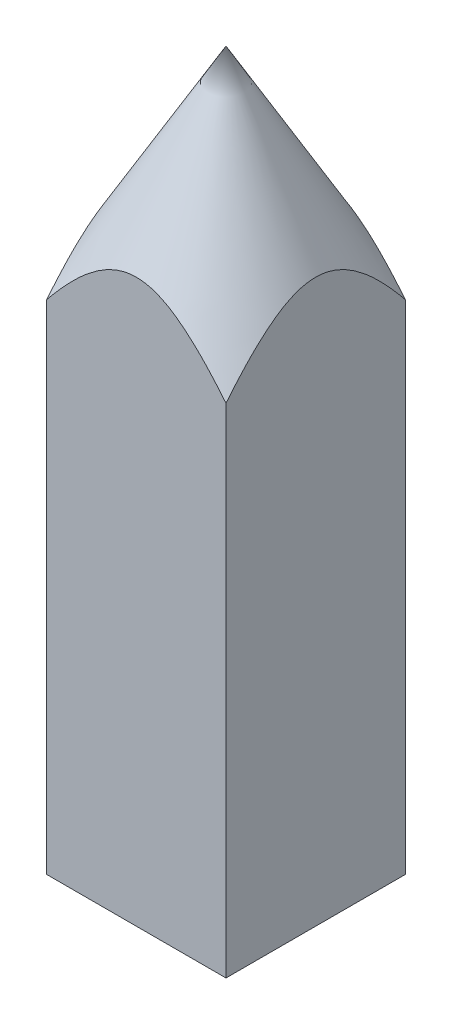
ISO-10303-21;
HEADER;
FILE_DESCRIPTION(('STEP AP214'),'2;1');
FILE_NAME('part.step','',(''),(''),'','','');
FILE_SCHEMA(('AUTOMOTIVE_DESIGN { 1 0 10303 214 1 1 1 1 }'));
ENDSEC;
DATA;
#1=APPLICATION_CONTEXT('core data for automotive mechanical design processes');
#2=APPLICATION_PROTOCOL_DEFINITION('international standard','automotive_design',2000,#1);
#3=PRODUCT_CONTEXT('',#1,'mechanical');
#4=PRODUCT('Part','Part','',(#3));
#5=PRODUCT_RELATED_PRODUCT_CATEGORY('part','',(#4));
#6=PRODUCT_DEFINITION_FORMATION('','',#4);
#7=PRODUCT_DEFINITION_CONTEXT('part definition',#1,'design');
#8=PRODUCT_DEFINITION('design','',#6,#7);
#9=PRODUCT_DEFINITION_SHAPE('','',#8);
#10=(LENGTH_UNIT() NAMED_UNIT(*) SI_UNIT(.MILLI.,.METRE.));
#11=(NAMED_UNIT(*) PLANE_ANGLE_UNIT() SI_UNIT($,.RADIAN.));
#12=(NAMED_UNIT(*) SI_UNIT($,.STERADIAN.) SOLID_ANGLE_UNIT());
#13=UNCERTAINTY_MEASURE_WITH_UNIT(LENGTH_MEASURE(1.E-05),#10,'distance_accuracy_value','');
#14=(GEOMETRIC_REPRESENTATION_CONTEXT(3) GLOBAL_UNCERTAINTY_ASSIGNED_CONTEXT((#13)) GLOBAL_UNIT_ASSIGNED_CONTEXT((#10,
#11,#12)) REPRESENTATION_CONTEXT('',''));
#15=CARTESIAN_POINT('',(0.,0.,0.));
#16=DIRECTION('',(0.,0.,1.));
#17=DIRECTION('',(1.,0.,0.));
#18=AXIS2_PLACEMENT_3D('',#15,#16,#17);
#19=CARTESIAN_POINT('',(0.,27.7525512860761,0.));
#20=DIRECTION('',(0.,-1.,0.));
#21=DIRECTION('',(0.,0.,-1.));
#22=AXIS2_PLACEMENT_3D('',#19,#20,#21);
#23=CONICAL_SURFACE('',#22,7.07106781187,0.523598775598293);
#24=CARTESIAN_POINT('',(-5.0000000000032,22.5683912344682,-8.73424265280935));
#25=CARTESIAN_POINT('',(-5.0000000000032,22.8488023325333,-8.54766544211133));
#26=CARTESIAN_POINT('',(-5.0000000000032,23.1285649924239,-8.36010390508928));
#27=CARTESIAN_POINT('',(-5.0000000000032,23.6864621174469,-7.98250325130816));
#28=CARTESIAN_POINT('',(-5.0000000000032,23.9645963791151,-7.79246383412938));
#29=CARTESIAN_POINT('',(-5.0000000000032,24.5202429395061,-7.40847202366486));
#30=CARTESIAN_POINT('',(-5.0000000000032,24.7977449184527,-7.21450466672879));
#31=CARTESIAN_POINT('',(-5.0000000000032,25.3501443903616,-6.82292758607559));
#32=CARTESIAN_POINT('',(-5.0000000000032,25.6250420497034,-6.62531809744771));
#33=CARTESIAN_POINT('',(-5.0000000000032,26.188603526577,-6.2130458318071));
#34=CARTESIAN_POINT('',(-5.0000000000032,26.4770533265441,-5.99808935307075));
#35=CARTESIAN_POINT('',(-5.0000000000032,27.0488803919948,-5.56155576253747));
#36=CARTESIAN_POINT('',(-5.0000000000032,27.3322580280372,-5.33997913757409));
#37=CARTESIAN_POINT('',(-5.0000000000032,27.891404034399,-4.8885254808277));
#38=CARTESIAN_POINT('',(-5.0000000000032,28.1671873104133,-4.65866711052706));
#39=CARTESIAN_POINT('',(-5.0000000000032,28.5730334827993,-4.30498586101745));
#40=CARTESIAN_POINT('',(-5.0000000000032,28.7069891422274,-4.18563039902351));
#41=CARTESIAN_POINT('',(-5.0000000000032,28.9716596249654,-3.94338595905392));
#42=CARTESIAN_POINT('',(-5.0000000000032,29.1023747793685,-3.82049734486626));
#43=CARTESIAN_POINT('',(-5.0000000000032,29.3006587775693,-3.62788939671447));
#44=CARTESIAN_POINT('',(-5.0000000000032,29.3696721084249,-3.55965615240548));
#45=CARTESIAN_POINT('',(-5.0000000000032,29.5063266042223,-3.42182961094149));
#46=CARTESIAN_POINT('',(-5.0000000000032,29.573967760085,-3.35223630479346));
#47=CARTESIAN_POINT('',(-5.0000000000032,29.7746016420278,-3.14114734004477));
#48=CARTESIAN_POINT('',(-5.0000000000032,29.9052498509677,-2.99739549056884));
#49=CARTESIAN_POINT('',(-5.0000000000032,30.1572599606067,-2.70358444641824));
#50=CARTESIAN_POINT('',(-5.0000000000032,30.2786783938822,-2.55357415983834));
#51=CARTESIAN_POINT('',(-5.0000000000032,30.5099360300796,-2.24494421601222));
#52=CARTESIAN_POINT('',(-5.0000000000032,30.6197847156706,-2.08633177328418));
#53=CARTESIAN_POINT('',(-5.0000000000032,30.8267067440477,-1.75349310468541));
#54=CARTESIAN_POINT('',(-5.0000000000032,30.9232393799582,-1.5789244827072));
#55=CARTESIAN_POINT('',(-5.0000000000032,31.091508471754,-1.21805588659846));
#56=CARTESIAN_POINT('',(-5.0000000000032,31.1632895384725,-1.03177774138264));
#57=CARTESIAN_POINT('',(-5.0000000000032,31.2415250010389,-0.759443677962484));
#58=CARTESIAN_POINT('',(-5.0000000000032,31.2618183654125,-0.677290209246679));
#59=CARTESIAN_POINT('',(-5.0000000000032,31.2956886568315,-0.511625448329237));
#60=CARTESIAN_POINT('',(-5.0000000000032,31.3092686969921,-0.428114804071425));
#61=CARTESIAN_POINT('',(-5.0000000000032,31.3292366815338,-0.260239655929384));
#62=CARTESIAN_POINT('',(-5.0000000000032,31.3356252545041,-0.175875227322927));
#63=CARTESIAN_POINT('',(-5.0000000000032,31.3409735497912,-0.00690787450947152));
#64=CARTESIAN_POINT('',(-5.0000000000032,31.3399331849406,0.0776950524843012));
#65=CARTESIAN_POINT('',(-5.0000000000032,31.3304627906657,0.246432319192583));
#66=CARTESIAN_POINT('',(-5.0000000000032,31.322037365129,0.330566917986499));
#67=CARTESIAN_POINT('',(-5.0000000000032,31.2981247288211,0.497838313341764));
#68=CARTESIAN_POINT('',(-5.0000000000032,31.2826345962884,0.580974682449183));
#69=CARTESIAN_POINT('',(-5.0000000000032,31.2263227748397,0.828080127763468));
#70=CARTESIAN_POINT('',(-5.0000000000032,31.1756517799774,0.989865059878494));
#71=CARTESIAN_POINT('',(-5.0000000000032,31.065225120645,1.27500229542668));
#72=CARTESIAN_POINT('',(-5.0000000000032,31.0090386070797,1.3998050783153));
#73=CARTESIAN_POINT('',(-5.0000000000032,30.885855530921,1.64403341019271));
#74=CARTESIAN_POINT('',(-5.0000000000032,30.8188512158637,1.76345502372688));
#75=CARTESIAN_POINT('',(-5.0000000000032,30.6760810780076,1.99764109197237));
#76=CARTESIAN_POINT('',(-5.0000000000032,30.6002756058629,2.11238105527226));
#77=CARTESIAN_POINT('',(-5.0000000000032,30.442046875319,2.33709595239964));
#78=CARTESIAN_POINT('',(-5.0000000000032,30.3596263110444,2.44707279828405));
#79=CARTESIAN_POINT('',(-5.0000000000032,30.1852826173909,2.66828443026841));
#80=CARTESIAN_POINT('',(-5.0000000000032,30.0930902207694,2.77930568270385));
#81=CARTESIAN_POINT('',(-5.0000000000032,29.904132220986,2.99740358957157));
#82=CARTESIAN_POINT('',(-5.0000000000032,29.8073656519854,3.10447940235217));
#83=CARTESIAN_POINT('',(-5.0000000000032,29.6100974451829,3.31530318432315));
#84=CARTESIAN_POINT('',(-5.0000000000032,29.5095924744544,3.41904802250084));
#85=CARTESIAN_POINT('',(-5.0000000000032,29.3056078476953,3.62357784634007));
#86=CARTESIAN_POINT('',(-5.0000000000032,29.2021279164447,3.72436255639883));
#87=CARTESIAN_POINT('',(-5.0000000000032,28.8873074966219,4.02358697141117));
#88=CARTESIAN_POINT('',(-5.0000000000032,28.6722905272445,4.21815898657849));
#89=CARTESIAN_POINT('',(-5.0000000000032,28.2355845959083,4.5993658283135));
#90=CARTESIAN_POINT('',(-5.0000000000032,28.0138988253118,4.78600435143498));
#91=CARTESIAN_POINT('',(-5.0000000000032,27.5621270292072,5.15600289491752));
#92=CARTESIAN_POINT('',(-5.0000000000032,27.3319643690637,5.33926903528303));
#93=CARTESIAN_POINT('',(-5.0000000000032,26.8677702068221,5.70086526331646));
#94=CARTESIAN_POINT('',(-5.0000000000032,26.6337382951878,5.87919482306627));
#95=CARTESIAN_POINT('',(-5.0000000000032,26.1632602679728,6.23145183617739));
#96=CARTESIAN_POINT('',(-5.0000000000032,25.9268212226582,6.40538875522377));
#97=CARTESIAN_POINT('',(-5.0000000000032,25.4516120521142,6.75001674844246));
#98=CARTESIAN_POINT('',(-5.0000000000032,25.2128420430234,6.92070798309213));
#99=CARTESIAN_POINT('',(-5.0000000000032,24.7066964971504,7.2782887124243));
#100=CARTESIAN_POINT('',(-5.0000000000032,24.4390987294906,7.4648632691325));
#101=CARTESIAN_POINT('',(-5.0000000000032,23.9020261686513,7.83529329559786));
#102=CARTESIAN_POINT('',(-5.0000000000032,23.6325513516572,8.01914873076412));
#103=CARTESIAN_POINT('',(-5.0000000000032,22.8218197230258,8.56736118954024));
#104=CARTESIAN_POINT('',(-5.0000000000032,22.2782826785292,8.92834548576797));
#105=CARTESIAN_POINT('',(-5.0000000000032,21.1869053508917,9.64396800791291));
#106=CARTESIAN_POINT('',(-5.0000000000032,20.6390642066892,9.99860491494591));
#107=CARTESIAN_POINT('',(-5.0000000000032,19.5403141467977,10.7031012010906));
#108=CARTESIAN_POINT('',(-5.0000000000032,18.9894051986819,11.0529605295676));
#109=CARTESIAN_POINT('',(-5.0000000000032,17.8843101568646,11.7496447825337));
#110=CARTESIAN_POINT('',(-5.0000000000032,17.3301199849934,12.0964632285595));
#111=CARTESIAN_POINT('',(-5.0000000000032,16.2199545345547,12.7872367719154));
#112=CARTESIAN_POINT('',(-5.0000000000032,15.6639792445285,13.1311918508144));
#113=CARTESIAN_POINT('',(-5.0000000000032,14.5506943032741,13.8167748625702));
#114=CARTESIAN_POINT('',(-5.0000000000032,13.993384831004,14.1584030862264));
#115=CARTESIAN_POINT('',(-5.0000000000032,12.8776346479052,14.8398070379077));
#116=CARTESIAN_POINT('',(-5.0000000000032,12.3191939362963,15.1795827646542));
#117=CARTESIAN_POINT('',(-5.0000000000032,10.7603892302575,16.1251264253137));
#118=CARTESIAN_POINT('',(-5.0000000000032,9.75901496038002,16.7292286185559));
#119=CARTESIAN_POINT('',(-5.0000000000032,7.75412384977833,17.9339498346395));
#120=CARTESIAN_POINT('',(-5.0000000000032,6.75060692873238,18.5345687236502));
#121=CARTESIAN_POINT('',(-5.0000000000032,4.74447779610894,19.7317063138774));
#122=CARTESIAN_POINT('',(-5.0000000000032,3.74186943274885,20.3282314671117));
#123=CARTESIAN_POINT('',(-5.0000000000032,1.73548232768086,21.5192101152898));
#124=CARTESIAN_POINT('',(-5.0000000000032,0.73170363932912,22.1136637001009));
#125=CARTESIAN_POINT('',(-5.0000000000032,-0.272510272651626,22.7073782697804));
#126=B_SPLINE_CURVE_WITH_KNOTS('',3,(#24,#25,#26,#27,#28,#29,#30,#31,#32,#33,#34,#35,#36,#37,
#38,#39,#40,#41,#42,#43,#44,#45,#46,#47,#48,#49,#50,#51,#52,#53,#54,#55,#56,#57,#58,#59,#60,#61,
#62,#63,#64,#65,#66,#67,#68,#69,#70,#71,#72,#73,#74,#75,#76,#77,#78,#79,#80,#81,#82,#83,#84,#85,
#86,#87,#88,#89,#90,#91,#92,#93,#94,#95,#96,#97,#98,#99,#100,#101,#102,#103,#104,#105,#106,#107,
#108,#109,#110,#111,#112,#113,#114,#115,#116,#117,#118,#119,#120,#121,#122,#123,#124,#125),
.UNSPECIFIED.,.F.,.F.,(4,2,2,2,2,2,2,2,2,2,2,2,2,2,2,2,2,2,2,2,2,2,2,2,2,2,2,2,2,2,2,2,2,2,2,2,
2,2,2,2,2,2,2,2,2,2,2,2,2,2,4),(0.,1.01043803253413,2.02099973186052,3.03668997097113,
4.05231487818199,5.1314451030695,6.21049616505982,7.28725160962294,7.82545051008001,
8.36359419241303,8.65472547500499,8.94585868327325,9.52835361518777,10.1069319804136,
10.6850323857187,11.2821955337718,11.8782766929207,12.1319146181267,12.3854348152905,
12.6389328511338,12.8924338613992,13.1457769500412,13.3992249093062,13.9057658078872,
14.3158167625183,14.7261628909995,15.1384351427028,15.5505403323544,15.9833136567052,
16.4161787731449,16.8494395176064,17.282740473759,18.1523986743461,19.021647119891,
19.9041978407702,20.7868425798832,21.6673869221442,22.5478876135812,23.526522554569,
24.5051699344247,26.4625633841046,28.420358934164,30.3781752176323,32.3394621012105,
34.3007615995534,36.2618113126743,38.2228623790786,41.7312993496417,45.2398702352303,
48.7398092363001,52.2395944667742),.UNSPECIFIED.);
#127=CARTESIAN_POINT('',(-5.0000000000032,27.7525512860761,5.0000000000032));
#128=VERTEX_POINT('',#127);
#129=CARTESIAN_POINT('',(-5.0000000000032,27.7525512860761,-5.0000000000032));
#130=VERTEX_POINT('',#129);
#131=EDGE_CURVE('E12',#128,#130,#126,.F.);
#132=ORIENTED_EDGE('',*,*,#131,.F.);
#133=CARTESIAN_POINT('',(-8.73424265280935,22.5683912344682,5.0000000000032));
#134=CARTESIAN_POINT('',(-8.54766544211133,22.8488023325333,5.0000000000032));
#135=CARTESIAN_POINT('',(-8.36010390508928,23.1285649924239,5.0000000000032));
#136=CARTESIAN_POINT('',(-7.98250325130816,23.6864621174469,5.0000000000032));
#137=CARTESIAN_POINT('',(-7.79246383412938,23.9645963791151,5.0000000000032));
#138=CARTESIAN_POINT('',(-7.40847202366486,24.5202429395061,5.0000000000032));
#139=CARTESIAN_POINT('',(-7.21450466672879,24.7977449184527,5.0000000000032));
#140=CARTESIAN_POINT('',(-6.82292758607559,25.3501443903616,5.0000000000032));
#141=CARTESIAN_POINT('',(-6.62531809744771,25.6250420497034,5.0000000000032));
#142=CARTESIAN_POINT('',(-6.2130458318071,26.188603526577,5.0000000000032));
#143=CARTESIAN_POINT('',(-5.99808935307075,26.4770533265441,5.0000000000032));
#144=CARTESIAN_POINT('',(-5.56155576253747,27.0488803919947,5.0000000000032));
#145=CARTESIAN_POINT('',(-5.33997913757409,27.3322580280372,5.0000000000032));
#146=CARTESIAN_POINT('',(-4.8885254808277,27.891404034399,5.0000000000032));
#147=CARTESIAN_POINT('',(-4.65866711052706,28.1671873104133,5.0000000000032));
#148=CARTESIAN_POINT('',(-4.30498586101745,28.5730334827993,5.0000000000032));
#149=CARTESIAN_POINT('',(-4.18563039902352,28.7069891422274,5.0000000000032));
#150=CARTESIAN_POINT('',(-3.94338595905392,28.9716596249654,5.0000000000032));
#151=CARTESIAN_POINT('',(-3.82049734486626,29.1023747793685,5.0000000000032));
#152=CARTESIAN_POINT('',(-3.62788939671446,29.3006587775693,5.0000000000032));
#153=CARTESIAN_POINT('',(-3.55965615240548,29.3696721084249,5.0000000000032));
#154=CARTESIAN_POINT('',(-3.42182961094149,29.5063266042223,5.0000000000032));
#155=CARTESIAN_POINT('',(-3.35223630479346,29.573967760085,5.0000000000032));
#156=CARTESIAN_POINT('',(-3.14114734004476,29.7746016420278,5.0000000000032));
#157=CARTESIAN_POINT('',(-2.99739549056884,29.9052498509677,5.0000000000032));
#158=CARTESIAN_POINT('',(-2.70358444641824,30.1572599606067,5.0000000000032));
#159=CARTESIAN_POINT('',(-2.55357415983834,30.2786783938821,5.0000000000032));
#160=CARTESIAN_POINT('',(-2.24494421601222,30.5099360300796,5.0000000000032));
#161=CARTESIAN_POINT('',(-2.08633177328418,30.6197847156706,5.0000000000032));
#162=CARTESIAN_POINT('',(-1.75349310468541,30.8267067440477,5.0000000000032));
#163=CARTESIAN_POINT('',(-1.5789244827072,30.9232393799582,5.0000000000032));
#164=CARTESIAN_POINT('',(-1.21805588659846,31.091508471754,5.0000000000032));
#165=CARTESIAN_POINT('',(-1.03177774138264,31.1632895384725,5.0000000000032));
#166=CARTESIAN_POINT('',(-0.759443677962482,31.2415250010389,5.0000000000032));
#167=CARTESIAN_POINT('',(-0.677290209246677,31.2618183654125,5.0000000000032));
#168=CARTESIAN_POINT('',(-0.511625448329235,31.2956886568315,5.0000000000032));
#169=CARTESIAN_POINT('',(-0.428114804071423,31.3092686969921,5.0000000000032));
#170=CARTESIAN_POINT('',(-0.260239655929383,31.3292366815338,5.0000000000032));
#171=CARTESIAN_POINT('',(-0.175875227322925,31.3356252545041,5.0000000000032));
#172=CARTESIAN_POINT('',(-0.00690787450947108,31.3409735497912,5.0000000000032));
#173=CARTESIAN_POINT('',(0.0776950524843018,31.3399331849406,5.0000000000032));
#174=CARTESIAN_POINT('',(0.246432319192584,31.3304627906657,5.0000000000032));
#175=CARTESIAN_POINT('',(0.330566917986499,31.322037365129,5.0000000000032));
#176=CARTESIAN_POINT('',(0.497838313341765,31.2981247288211,5.0000000000032));
#177=CARTESIAN_POINT('',(0.580974682449183,31.2826345962884,5.0000000000032));
#178=CARTESIAN_POINT('',(0.828080127763468,31.2263227748397,5.0000000000032));
#179=CARTESIAN_POINT('',(0.989865059878494,31.1756517799774,5.0000000000032));
#180=CARTESIAN_POINT('',(1.27500229542668,31.065225120645,5.0000000000032));
#181=CARTESIAN_POINT('',(1.3998050783153,31.0090386070797,5.0000000000032));
#182=CARTESIAN_POINT('',(1.64403341019271,30.885855530921,5.0000000000032));
#183=CARTESIAN_POINT('',(1.76345502372688,30.8188512158637,5.0000000000032));
#184=CARTESIAN_POINT('',(1.99764109197237,30.6760810780076,5.0000000000032));
#185=CARTESIAN_POINT('',(2.11238105527226,30.6002756058629,5.0000000000032));
#186=CARTESIAN_POINT('',(2.33709595239964,30.442046875319,5.0000000000032));
#187=CARTESIAN_POINT('',(2.44707279828405,30.3596263110444,5.0000000000032));
#188=CARTESIAN_POINT('',(2.66828443026841,30.1852826173909,5.0000000000032));
#189=CARTESIAN_POINT('',(2.77930568270385,30.0930902207694,5.0000000000032));
#190=CARTESIAN_POINT('',(2.99740358957157,29.904132220986,5.0000000000032));
#191=CARTESIAN_POINT('',(3.10447940235217,29.8073656519854,5.0000000000032));
#192=CARTESIAN_POINT('',(3.31530318432314,29.6100974451829,5.0000000000032));
#193=CARTESIAN_POINT('',(3.41904802250083,29.5095924744545,5.0000000000032));
#194=CARTESIAN_POINT('',(3.62357784634006,29.3056078476954,5.0000000000032));
#195=CARTESIAN_POINT('',(3.72436255639882,29.2021279164447,5.0000000000032));
#196=CARTESIAN_POINT('',(4.02358697141116,28.8873074966219,5.0000000000032));
#197=CARTESIAN_POINT('',(4.21815898657848,28.6722905272445,5.0000000000032));
#198=CARTESIAN_POINT('',(4.59936582831349,28.2355845959083,5.0000000000032));
#199=CARTESIAN_POINT('',(4.78600435143498,28.0138988253118,5.0000000000032));
#200=CARTESIAN_POINT('',(5.15600289491751,27.5621270292072,5.0000000000032));
#201=CARTESIAN_POINT('',(5.33926903528302,27.3319643690637,5.0000000000032));
#202=CARTESIAN_POINT('',(5.70086526331646,26.8677702068221,5.0000000000032));
#203=CARTESIAN_POINT('',(5.87919482306626,26.6337382951878,5.0000000000032));
#204=CARTESIAN_POINT('',(6.23145183617738,26.1632602679728,5.0000000000032));
#205=CARTESIAN_POINT('',(6.40538875522376,25.9268212226583,5.0000000000032));
#206=CARTESIAN_POINT('',(6.75001674844246,25.4516120521142,5.0000000000032));
#207=CARTESIAN_POINT('',(6.92070798309212,25.2128420430234,5.0000000000032));
#208=CARTESIAN_POINT('',(7.27828871242429,24.7066964971504,5.0000000000032));
#209=CARTESIAN_POINT('',(7.46486326913248,24.4390987294906,5.0000000000032));
#210=CARTESIAN_POINT('',(7.83529329559784,23.9020261686513,5.0000000000032));
#211=CARTESIAN_POINT('',(8.01914873076411,23.6325513516572,5.0000000000032));
#212=CARTESIAN_POINT('',(8.56736118954023,22.8218197230258,5.0000000000032));
#213=CARTESIAN_POINT('',(8.92834548576795,22.2782826785292,5.0000000000032));
#214=CARTESIAN_POINT('',(9.6439680079129,21.1869053508917,5.0000000000032));
#215=CARTESIAN_POINT('',(9.9986049149459,20.6390642066892,5.0000000000032));
#216=CARTESIAN_POINT('',(10.7031012010906,19.5403141467977,5.0000000000032));
#217=CARTESIAN_POINT('',(11.0529605295676,18.9894051986819,5.0000000000032));
#218=CARTESIAN_POINT('',(11.7496447825337,17.8843101568646,5.0000000000032));
#219=CARTESIAN_POINT('',(12.0964632285595,17.3301199849934,5.0000000000032));
#220=CARTESIAN_POINT('',(12.7872367719154,16.2199545345547,5.0000000000032));
#221=CARTESIAN_POINT('',(13.1311918508144,15.6639792445285,5.0000000000032));
#222=CARTESIAN_POINT('',(13.8167748625702,14.5506943032741,5.0000000000032));
#223=CARTESIAN_POINT('',(14.1584030862264,13.993384831004,5.0000000000032));
#224=CARTESIAN_POINT('',(14.8398070379077,12.8776346479052,5.0000000000032));
#225=CARTESIAN_POINT('',(15.1795827646542,12.3191939362963,5.0000000000032));
#226=CARTESIAN_POINT('',(16.1251264253137,10.7603892302576,5.0000000000032));
#227=CARTESIAN_POINT('',(16.7292286185559,9.75901496038003,5.0000000000032));
#228=CARTESIAN_POINT('',(17.9339498346395,7.75412384977835,5.0000000000032));
#229=CARTESIAN_POINT('',(18.5345687236502,6.7506069287324,5.0000000000032));
#230=CARTESIAN_POINT('',(19.7317063138774,4.74447779610896,5.0000000000032));
#231=CARTESIAN_POINT('',(20.3282314671116,3.74186943274887,5.0000000000032));
#232=CARTESIAN_POINT('',(21.5192101152898,1.73548232768087,5.0000000000032));
#233=CARTESIAN_POINT('',(22.1136637001009,0.73170363932913,5.0000000000032));
#234=CARTESIAN_POINT('',(22.7073782697804,-0.272510272651613,5.0000000000032));
#235=B_SPLINE_CURVE_WITH_KNOTS('',3,(#133,#134,#135,#136,#137,#138,#139,#140,#141,#142,#143,
#144,#145,#146,#147,#148,#149,#150,#151,#152,#153,#154,#155,#156,#157,#158,#159,#160,#161,#162,
#163,#164,#165,#166,#167,#168,#169,#170,#171,#172,#173,#174,#175,#176,#177,#178,#179,#180,#181,
#182,#183,#184,#185,#186,#187,#188,#189,#190,#191,#192,#193,#194,#195,#196,#197,#198,#199,#200,
#201,#202,#203,#204,#205,#206,#207,#208,#209,#210,#211,#212,#213,#214,#215,#216,#217,#218,#219,
#220,#221,#222,#223,#224,#225,#226,#227,#228,#229,#230,#231,#232,#233,#234),.UNSPECIFIED.,.F.,
.F.,(4,2,2,2,2,2,2,2,2,2,2,2,2,2,2,2,2,2,2,2,2,2,2,2,2,2,2,2,2,2,2,2,2,2,2,2,2,2,2,2,2,2,2,2,2,
2,2,2,2,2,4),(0.,1.01043803253413,2.02099973186052,3.03668997097113,4.05231487818199,
5.1314451030695,6.21049616505981,7.28725160962294,7.82545051008001,8.36359419241303,
8.65472547500499,8.94585868327326,9.52835361518778,10.1069319804136,10.6850323857187,
11.2821955337718,11.8782766929207,12.1319146181267,12.3854348152905,12.6389328511338,
12.8924338613992,13.1457769500412,13.3992249093062,13.9057658078872,14.3158167625183,
14.7261628909995,15.1384351427028,15.5505403323544,15.9833136567052,16.4161787731449,
16.8494395176064,17.282740473759,18.1523986743461,19.021647119891,19.9041978407702,
20.7868425798832,21.6673869221442,22.5478876135812,23.526522554569,24.5051699344247,
26.4625633841046,28.420358934164,30.3781752176322,32.3394621012104,34.3007615995534,
36.2618113126743,38.2228623790785,41.7312993496416,45.2398702352303,48.7398092363001,
52.2395944667742),.UNSPECIFIED.);
#236=CARTESIAN_POINT('',(5.0000000000032,27.7525512860761,5.0000000000032));
#237=VERTEX_POINT('',#236);
#238=EDGE_CURVE('E45',#237,#128,#235,.F.);
#239=ORIENTED_EDGE('',*,*,#238,.F.);
#240=CARTESIAN_POINT('',(5.0000000000032,22.5683912344682,-8.73424265280935));
#241=CARTESIAN_POINT('',(5.0000000000032,22.8488023325333,-8.54766544211133));
#242=CARTESIAN_POINT('',(5.0000000000032,23.1285649924239,-8.36010390508928));
#243=CARTESIAN_POINT('',(5.0000000000032,23.6864621174469,-7.98250325130816));
#244=CARTESIAN_POINT('',(5.0000000000032,23.9645963791151,-7.79246383412938));
#245=CARTESIAN_POINT('',(5.0000000000032,24.5202429395061,-7.40847202366486));
#246=CARTESIAN_POINT('',(5.0000000000032,24.7977449184527,-7.21450466672879));
#247=CARTESIAN_POINT('',(5.0000000000032,25.3501443903616,-6.82292758607559));
#248=CARTESIAN_POINT('',(5.0000000000032,25.6250420497034,-6.62531809744771));
#249=CARTESIAN_POINT('',(5.0000000000032,26.188603526577,-6.2130458318071));
#250=CARTESIAN_POINT('',(5.0000000000032,26.4770533265441,-5.99808935307075));
#251=CARTESIAN_POINT('',(5.0000000000032,27.0488803919948,-5.56155576253747));
#252=CARTESIAN_POINT('',(5.0000000000032,27.3322580280372,-5.33997913757409));
#253=CARTESIAN_POINT('',(5.0000000000032,27.891404034399,-4.8885254808277));
#254=CARTESIAN_POINT('',(5.0000000000032,28.1671873104133,-4.65866711052706));
#255=CARTESIAN_POINT('',(5.0000000000032,28.5730334827993,-4.30498586101745));
#256=CARTESIAN_POINT('',(5.0000000000032,28.7069891422274,-4.18563039902351));
#257=CARTESIAN_POINT('',(5.0000000000032,28.9716596249654,-3.94338595905392));
#258=CARTESIAN_POINT('',(5.0000000000032,29.1023747793685,-3.82049734486626));
#259=CARTESIAN_POINT('',(5.0000000000032,29.3006587775693,-3.62788939671447));
#260=CARTESIAN_POINT('',(5.0000000000032,29.3696721084249,-3.55965615240548));
#261=CARTESIAN_POINT('',(5.0000000000032,29.5063266042223,-3.42182961094149));
#262=CARTESIAN_POINT('',(5.0000000000032,29.573967760085,-3.35223630479346));
#263=CARTESIAN_POINT('',(5.0000000000032,29.7746016420278,-3.14114734004477));
#264=CARTESIAN_POINT('',(5.0000000000032,29.9052498509677,-2.99739549056884));
#265=CARTESIAN_POINT('',(5.0000000000032,30.1572599606067,-2.70358444641824));
#266=CARTESIAN_POINT('',(5.0000000000032,30.2786783938822,-2.55357415983834));
#267=CARTESIAN_POINT('',(5.0000000000032,30.5099360300796,-2.24494421601222));
#268=CARTESIAN_POINT('',(5.0000000000032,30.6197847156706,-2.08633177328418));
#269=CARTESIAN_POINT('',(5.0000000000032,30.8267067440477,-1.75349310468541));
#270=CARTESIAN_POINT('',(5.0000000000032,30.9232393799582,-1.5789244827072));
#271=CARTESIAN_POINT('',(5.0000000000032,31.091508471754,-1.21805588659846));
#272=CARTESIAN_POINT('',(5.0000000000032,31.1632895384725,-1.03177774138264));
#273=CARTESIAN_POINT('',(5.0000000000032,31.2415250010389,-0.759443677962484));
#274=CARTESIAN_POINT('',(5.0000000000032,31.2618183654125,-0.677290209246679));
#275=CARTESIAN_POINT('',(5.0000000000032,31.2956886568315,-0.511625448329237));
#276=CARTESIAN_POINT('',(5.0000000000032,31.3092686969921,-0.428114804071425));
#277=CARTESIAN_POINT('',(5.0000000000032,31.3292366815338,-0.260239655929384));
#278=CARTESIAN_POINT('',(5.0000000000032,31.3356252545041,-0.175875227322927));
#279=CARTESIAN_POINT('',(5.0000000000032,31.3409735497912,-0.00690787450947152));
#280=CARTESIAN_POINT('',(5.0000000000032,31.3399331849406,0.0776950524843012));
#281=CARTESIAN_POINT('',(5.0000000000032,31.3304627906657,0.246432319192583));
#282=CARTESIAN_POINT('',(5.0000000000032,31.322037365129,0.330566917986499));
#283=CARTESIAN_POINT('',(5.0000000000032,31.2981247288211,0.497838313341764));
#284=CARTESIAN_POINT('',(5.0000000000032,31.2826345962884,0.580974682449183));
#285=CARTESIAN_POINT('',(5.0000000000032,31.2263227748397,0.828080127763468));
#286=CARTESIAN_POINT('',(5.0000000000032,31.1756517799774,0.989865059878494));
#287=CARTESIAN_POINT('',(5.0000000000032,31.065225120645,1.27500229542668));
#288=CARTESIAN_POINT('',(5.0000000000032,31.0090386070797,1.3998050783153));
#289=CARTESIAN_POINT('',(5.0000000000032,30.885855530921,1.64403341019271));
#290=CARTESIAN_POINT('',(5.0000000000032,30.8188512158637,1.76345502372688));
#291=CARTESIAN_POINT('',(5.0000000000032,30.6760810780076,1.99764109197237));
#292=CARTESIAN_POINT('',(5.0000000000032,30.6002756058629,2.11238105527226));
#293=CARTESIAN_POINT('',(5.0000000000032,30.442046875319,2.33709595239964));
#294=CARTESIAN_POINT('',(5.0000000000032,30.3596263110444,2.44707279828405));
#295=CARTESIAN_POINT('',(5.0000000000032,30.1852826173909,2.66828443026841));
#296=CARTESIAN_POINT('',(5.0000000000032,30.0930902207694,2.77930568270385));
#297=CARTESIAN_POINT('',(5.0000000000032,29.904132220986,2.99740358957157));
#298=CARTESIAN_POINT('',(5.0000000000032,29.8073656519854,3.10447940235217));
#299=CARTESIAN_POINT('',(5.0000000000032,29.6100974451829,3.31530318432315));
#300=CARTESIAN_POINT('',(5.0000000000032,29.5095924744544,3.41904802250084));
#301=CARTESIAN_POINT('',(5.0000000000032,29.3056078476953,3.62357784634007));
#302=CARTESIAN_POINT('',(5.0000000000032,29.2021279164447,3.72436255639883));
#303=CARTESIAN_POINT('',(5.0000000000032,28.8873074966219,4.02358697141117));
#304=CARTESIAN_POINT('',(5.0000000000032,28.6722905272445,4.21815898657849));
#305=CARTESIAN_POINT('',(5.0000000000032,28.2355845959083,4.5993658283135));
#306=CARTESIAN_POINT('',(5.0000000000032,28.0138988253118,4.78600435143498));
#307=CARTESIAN_POINT('',(5.0000000000032,27.5621270292072,5.15600289491752));
#308=CARTESIAN_POINT('',(5.0000000000032,27.3319643690637,5.33926903528303));
#309=CARTESIAN_POINT('',(5.0000000000032,26.8677702068221,5.70086526331646));
#310=CARTESIAN_POINT('',(5.0000000000032,26.6337382951878,5.87919482306627));
#311=CARTESIAN_POINT('',(5.0000000000032,26.1632602679728,6.23145183617739));
#312=CARTESIAN_POINT('',(5.0000000000032,25.9268212226582,6.40538875522377));
#313=CARTESIAN_POINT('',(5.0000000000032,25.4516120521142,6.75001674844246));
#314=CARTESIAN_POINT('',(5.0000000000032,25.2128420430234,6.92070798309213));
#315=CARTESIAN_POINT('',(5.0000000000032,24.7066964971504,7.2782887124243));
#316=CARTESIAN_POINT('',(5.0000000000032,24.4390987294906,7.4648632691325));
#317=CARTESIAN_POINT('',(5.0000000000032,23.9020261686513,7.83529329559786));
#318=CARTESIAN_POINT('',(5.0000000000032,23.6325513516572,8.01914873076412));
#319=CARTESIAN_POINT('',(5.0000000000032,22.8218197230258,8.56736118954024));
#320=CARTESIAN_POINT('',(5.0000000000032,22.2782826785292,8.92834548576797));
#321=CARTESIAN_POINT('',(5.0000000000032,21.1869053508917,9.64396800791291));
#322=CARTESIAN_POINT('',(5.0000000000032,20.6390642066892,9.99860491494591));
#323=CARTESIAN_POINT('',(5.0000000000032,19.5403141467977,10.7031012010906));
#324=CARTESIAN_POINT('',(5.0000000000032,18.9894051986819,11.0529605295676));
#325=CARTESIAN_POINT('',(5.0000000000032,17.8843101568646,11.7496447825337));
#326=CARTESIAN_POINT('',(5.0000000000032,17.3301199849934,12.0964632285595));
#327=CARTESIAN_POINT('',(5.0000000000032,16.2199545345547,12.7872367719154));
#328=CARTESIAN_POINT('',(5.0000000000032,15.6639792445285,13.1311918508144));
#329=CARTESIAN_POINT('',(5.0000000000032,14.5506943032741,13.8167748625702));
#330=CARTESIAN_POINT('',(5.0000000000032,13.993384831004,14.1584030862264));
#331=CARTESIAN_POINT('',(5.0000000000032,12.8776346479052,14.8398070379077));
#332=CARTESIAN_POINT('',(5.0000000000032,12.3191939362963,15.1795827646542));
#333=CARTESIAN_POINT('',(5.0000000000032,10.7603892302575,16.1251264253137));
#334=CARTESIAN_POINT('',(5.0000000000032,9.75901496038002,16.7292286185559));
#335=CARTESIAN_POINT('',(5.0000000000032,7.75412384977833,17.9339498346395));
#336=CARTESIAN_POINT('',(5.0000000000032,6.75060692873238,18.5345687236502));
#337=CARTESIAN_POINT('',(5.0000000000032,4.74447779610894,19.7317063138774));
#338=CARTESIAN_POINT('',(5.0000000000032,3.74186943274885,20.3282314671117));
#339=CARTESIAN_POINT('',(5.0000000000032,1.73548232768086,21.5192101152898));
#340=CARTESIAN_POINT('',(5.0000000000032,0.73170363932912,22.1136637001009));
#341=CARTESIAN_POINT('',(5.0000000000032,-0.272510272651626,22.7073782697804));
#342=B_SPLINE_CURVE_WITH_KNOTS('',3,(#240,#241,#242,#243,#244,#245,#246,#247,#248,#249,#250,
#251,#252,#253,#254,#255,#256,#257,#258,#259,#260,#261,#262,#263,#264,#265,#266,#267,#268,#269,
#270,#271,#272,#273,#274,#275,#276,#277,#278,#279,#280,#281,#282,#283,#284,#285,#286,#287,#288,
#289,#290,#291,#292,#293,#294,#295,#296,#297,#298,#299,#300,#301,#302,#303,#304,#305,#306,#307,
#308,#309,#310,#311,#312,#313,#314,#315,#316,#317,#318,#319,#320,#321,#322,#323,#324,#325,#326,
#327,#328,#329,#330,#331,#332,#333,#334,#335,#336,#337,#338,#339,#340,#341),.UNSPECIFIED.,.F.,
.F.,(4,2,2,2,2,2,2,2,2,2,2,2,2,2,2,2,2,2,2,2,2,2,2,2,2,2,2,2,2,2,2,2,2,2,2,2,2,2,2,2,2,2,2,2,2,
2,2,2,2,2,4),(0.,1.01043803253413,2.02099973186052,3.03668997097113,4.05231487818199,
5.1314451030695,6.21049616505982,7.28725160962294,7.82545051008001,8.36359419241303,
8.65472547500499,8.94585868327325,9.52835361518777,10.1069319804136,10.6850323857187,
11.2821955337718,11.8782766929207,12.1319146181267,12.3854348152905,12.6389328511338,
12.8924338613992,13.1457769500412,13.3992249093062,13.9057658078872,14.3158167625183,
14.7261628909995,15.1384351427028,15.5505403323544,15.9833136567052,16.4161787731449,
16.8494395176064,17.282740473759,18.1523986743461,19.021647119891,19.9041978407702,
20.7868425798832,21.6673869221442,22.5478876135812,23.526522554569,24.5051699344247,
26.4625633841046,28.420358934164,30.3781752176323,32.3394621012105,34.3007615995534,
36.2618113126743,38.2228623790786,41.7312993496417,45.2398702352303,48.7398092363001,
52.2395944667742),.UNSPECIFIED.);
#343=CARTESIAN_POINT('',(5.0000000000032,27.7525512860761,-5.0000000000032));
#344=VERTEX_POINT('',#343);
#345=EDGE_CURVE('E113',#344,#237,#342,.T.);
#346=ORIENTED_EDGE('',*,*,#345,.F.);
#347=CARTESIAN_POINT('',(-8.73424265280935,22.5683912344682,-5.0000000000032));
#348=CARTESIAN_POINT('',(-8.54766544211133,22.8488023325333,-5.0000000000032));
#349=CARTESIAN_POINT('',(-8.36010390508928,23.1285649924239,-5.0000000000032));
#350=CARTESIAN_POINT('',(-7.98250325130816,23.6864621174469,-5.0000000000032));
#351=CARTESIAN_POINT('',(-7.79246383412938,23.9645963791151,-5.0000000000032));
#352=CARTESIAN_POINT('',(-7.40847202366486,24.5202429395061,-5.0000000000032));
#353=CARTESIAN_POINT('',(-7.21450466672879,24.7977449184527,-5.0000000000032));
#354=CARTESIAN_POINT('',(-6.82292758607558,25.3501443903616,-5.0000000000032));
#355=CARTESIAN_POINT('',(-6.6253180974477,25.6250420497034,-5.0000000000032));
#356=CARTESIAN_POINT('',(-6.2130458318071,26.188603526577,-5.0000000000032));
#357=CARTESIAN_POINT('',(-5.99808935307075,26.4770533265441,-5.0000000000032));
#358=CARTESIAN_POINT('',(-5.56155576253747,27.0488803919947,-5.0000000000032));
#359=CARTESIAN_POINT('',(-5.33997913757409,27.3322580280372,-5.0000000000032));
#360=CARTESIAN_POINT('',(-4.8885254808277,27.891404034399,-5.0000000000032));
#361=CARTESIAN_POINT('',(-4.65866711052706,28.1671873104133,-5.0000000000032));
#362=CARTESIAN_POINT('',(-4.30498586101745,28.5730334827993,-5.0000000000032));
#363=CARTESIAN_POINT('',(-4.18563039902351,28.7069891422274,-5.0000000000032));
#364=CARTESIAN_POINT('',(-3.94338595905391,28.9716596249654,-5.0000000000032));
#365=CARTESIAN_POINT('',(-3.82049734486626,29.1023747793685,-5.0000000000032));
#366=CARTESIAN_POINT('',(-3.62788939671446,29.3006587775693,-5.0000000000032));
#367=CARTESIAN_POINT('',(-3.55965615240548,29.3696721084248,-5.0000000000032));
#368=CARTESIAN_POINT('',(-3.42182961094149,29.5063266042223,-5.0000000000032));
#369=CARTESIAN_POINT('',(-3.35223630479346,29.573967760085,-5.0000000000032));
#370=CARTESIAN_POINT('',(-3.14114734004476,29.7746016420278,-5.0000000000032));
#371=CARTESIAN_POINT('',(-2.99739549056884,29.9052498509677,-5.0000000000032));
#372=CARTESIAN_POINT('',(-2.70358444641824,30.1572599606067,-5.0000000000032));
#373=CARTESIAN_POINT('',(-2.55357415983834,30.2786783938821,-5.0000000000032));
#374=CARTESIAN_POINT('',(-2.24494421601223,30.5099360300796,-5.0000000000032));
#375=CARTESIAN_POINT('',(-2.08633177328419,30.6197847156706,-5.0000000000032));
#376=CARTESIAN_POINT('',(-1.75349310468541,30.8267067440477,-5.0000000000032));
#377=CARTESIAN_POINT('',(-1.5789244827072,30.9232393799582,-5.0000000000032));
#378=CARTESIAN_POINT('',(-1.21805588659846,31.091508471754,-5.0000000000032));
#379=CARTESIAN_POINT('',(-1.03177774138264,31.1632895384725,-5.0000000000032));
#380=CARTESIAN_POINT('',(-0.759443677962484,31.2415250010389,-5.0000000000032));
#381=CARTESIAN_POINT('',(-0.677290209246679,31.2618183654125,-5.0000000000032));
#382=CARTESIAN_POINT('',(-0.511625448329235,31.2956886568315,-5.0000000000032));
#383=CARTESIAN_POINT('',(-0.428114804071423,31.309268696992,-5.0000000000032));
#384=CARTESIAN_POINT('',(-0.260239655929382,31.3292366815338,-5.0000000000032));
#385=CARTESIAN_POINT('',(-0.175875227322924,31.3356252545041,-5.0000000000032));
#386=CARTESIAN_POINT('',(-0.00690787450946978,31.3409735497912,-5.0000000000032));
#387=CARTESIAN_POINT('',(0.0776950524843031,31.3399331849406,-5.0000000000032));
#388=CARTESIAN_POINT('',(0.246432319192585,31.3304627906657,-5.0000000000032));
#389=CARTESIAN_POINT('',(0.330566917986501,31.322037365129,-5.0000000000032));
#390=CARTESIAN_POINT('',(0.497838313341767,31.2981247288211,-5.0000000000032));
#391=CARTESIAN_POINT('',(0.580974682449186,31.2826345962884,-5.0000000000032));
#392=CARTESIAN_POINT('',(0.828080127763472,31.2263227748397,-5.0000000000032));
#393=CARTESIAN_POINT('',(0.989865059878498,31.1756517799774,-5.0000000000032));
#394=CARTESIAN_POINT('',(1.27500229542668,31.065225120645,-5.0000000000032));
#395=CARTESIAN_POINT('',(1.39980507831531,31.0090386070797,-5.0000000000032));
#396=CARTESIAN_POINT('',(1.64403341019271,30.885855530921,-5.0000000000032));
#397=CARTESIAN_POINT('',(1.76345502372689,30.8188512158636,-5.0000000000032));
#398=CARTESIAN_POINT('',(1.99764109197237,30.6760810780076,-5.0000000000032));
#399=CARTESIAN_POINT('',(2.11238105527226,30.6002756058628,-5.0000000000032));
#400=CARTESIAN_POINT('',(2.33709595239965,30.442046875319,-5.0000000000032));
#401=CARTESIAN_POINT('',(2.44707279828406,30.3596263110443,-5.0000000000032));
#402=CARTESIAN_POINT('',(2.66828443026842,30.1852826173909,-5.0000000000032));
#403=CARTESIAN_POINT('',(2.77930568270386,30.0930902207694,-5.0000000000032));
#404=CARTESIAN_POINT('',(2.99740358957158,29.904132220986,-5.0000000000032));
#405=CARTESIAN_POINT('',(3.10447940235218,29.8073656519854,-5.0000000000032));
#406=CARTESIAN_POINT('',(3.31530318432316,29.6100974451829,-5.0000000000032));
#407=CARTESIAN_POINT('',(3.41904802250085,29.5095924744544,-5.0000000000032));
#408=CARTESIAN_POINT('',(3.62357784634008,29.3056078476953,-5.0000000000032));
#409=CARTESIAN_POINT('',(3.72436255639884,29.2021279164446,-5.0000000000032));
#410=CARTESIAN_POINT('',(4.02358697141119,28.8873074966218,-5.0000000000032));
#411=CARTESIAN_POINT('',(4.2181589865785,28.6722905272445,-5.0000000000032));
#412=CARTESIAN_POINT('',(4.59936582831352,28.2355845959083,-5.0000000000032));
#413=CARTESIAN_POINT('',(4.786004351435,28.0138988253118,-5.0000000000032));
#414=CARTESIAN_POINT('',(5.15600289491754,27.5621270292071,-5.0000000000032));
#415=CARTESIAN_POINT('',(5.33926903528306,27.3319643690637,-5.0000000000032));
#416=CARTESIAN_POINT('',(5.70086526331649,26.867770206822,-5.0000000000032));
#417=CARTESIAN_POINT('',(5.8791948230663,26.6337382951877,-5.0000000000032));
#418=CARTESIAN_POINT('',(6.23145183617742,26.1632602679728,-5.0000000000032));
#419=CARTESIAN_POINT('',(6.4053887552238,25.9268212226582,-5.0000000000032));
#420=CARTESIAN_POINT('',(6.7500167484425,25.4516120521142,-5.0000000000032));
#421=CARTESIAN_POINT('',(6.92070798309216,25.2128420430233,-5.0000000000032));
#422=CARTESIAN_POINT('',(7.27828871242433,24.7066964971503,-5.0000000000032));
#423=CARTESIAN_POINT('',(7.46486326913252,24.4390987294906,-5.0000000000032));
#424=CARTESIAN_POINT('',(7.83529329559788,23.9020261686513,-5.0000000000032));
#425=CARTESIAN_POINT('',(8.01914873076415,23.6325513516571,-5.0000000000032));
#426=CARTESIAN_POINT('',(8.56736118954027,22.8218197230258,-5.0000000000032));
#427=CARTESIAN_POINT('',(8.92834548576799,22.2782826785291,-5.0000000000032));
#428=CARTESIAN_POINT('',(9.64396800791294,21.1869053508917,-5.0000000000032));
#429=CARTESIAN_POINT('',(9.99860491494594,20.6390642066892,-5.0000000000032));
#430=CARTESIAN_POINT('',(10.7031012010906,19.5403141467977,-5.0000000000032));
#431=CARTESIAN_POINT('',(11.0529605295676,18.9894051986819,-5.0000000000032));
#432=CARTESIAN_POINT('',(11.7496447825337,17.8843101568646,-5.0000000000032));
#433=CARTESIAN_POINT('',(12.0964632285595,17.3301199849934,-5.0000000000032));
#434=CARTESIAN_POINT('',(12.7872367719154,16.2199545345547,-5.0000000000032));
#435=CARTESIAN_POINT('',(13.1311918508144,15.6639792445285,-5.0000000000032));
#436=CARTESIAN_POINT('',(13.8167748625702,14.5506943032741,-5.0000000000032));
#437=CARTESIAN_POINT('',(14.1584030862264,13.9933848310039,-5.0000000000032));
#438=CARTESIAN_POINT('',(14.8398070379077,12.8776346479052,-5.0000000000032));
#439=CARTESIAN_POINT('',(15.1795827646542,12.3191939362963,-5.0000000000032));
#440=CARTESIAN_POINT('',(16.1251264253137,10.7603892302575,-5.0000000000032));
#441=CARTESIAN_POINT('',(16.7292286185559,9.75901496037999,-5.0000000000032));
#442=CARTESIAN_POINT('',(17.9339498346395,7.7541238497783,-5.0000000000032));
#443=CARTESIAN_POINT('',(18.5345687236502,6.75060692873235,-5.0000000000032));
#444=CARTESIAN_POINT('',(19.7317063138774,4.7444777961089,-5.0000000000032));
#445=CARTESIAN_POINT('',(20.3282314671117,3.74186943274881,-5.0000000000032));
#446=CARTESIAN_POINT('',(21.5192101152898,1.73548232768081,-5.0000000000032));
#447=CARTESIAN_POINT('',(22.1136637001009,0.731703639329073,-5.0000000000032));
#448=CARTESIAN_POINT('',(22.7073782697805,-0.272510272651674,-5.0000000000032));
#449=B_SPLINE_CURVE_WITH_KNOTS('',3,(#347,#348,#349,#350,#351,#352,#353,#354,#355,#356,#357,
#358,#359,#360,#361,#362,#363,#364,#365,#366,#367,#368,#369,#370,#371,#372,#373,#374,#375,#376,
#377,#378,#379,#380,#381,#382,#383,#384,#385,#386,#387,#388,#389,#390,#391,#392,#393,#394,#395,
#396,#397,#398,#399,#400,#401,#402,#403,#404,#405,#406,#407,#408,#409,#410,#411,#412,#413,#414,
#415,#416,#417,#418,#419,#420,#421,#422,#423,#424,#425,#426,#427,#428,#429,#430,#431,#432,#433,
#434,#435,#436,#437,#438,#439,#440,#441,#442,#443,#444,#445,#446,#447,#448),.UNSPECIFIED.,.F.,
.F.,(4,2,2,2,2,2,2,2,2,2,2,2,2,2,2,2,2,2,2,2,2,2,2,2,2,2,2,2,2,2,2,2,2,2,2,2,2,2,2,2,2,2,2,2,2,
2,2,2,2,2,4),(0.,1.01043803253413,2.02099973186052,3.03668997097113,4.05231487818199,
5.1314451030695,6.21049616505981,7.28725160962294,7.82545051008001,8.36359419241303,
8.65472547500498,8.94585868327325,9.52835361518777,10.1069319804136,10.6850323857186,
11.2821955337718,11.8782766929207,12.1319146181267,12.3854348152905,12.6389328511338,
12.8924338613992,13.1457769500412,13.3992249093062,13.9057658078872,14.3158167625183,
14.7261628909995,15.1384351427028,15.5505403323544,15.9833136567052,16.4161787731449,
16.8494395176064,17.282740473759,18.1523986743461,19.021647119891,19.9041978407703,
20.7868425798832,21.6673869221442,22.5478876135812,23.526522554569,24.5051699344248,
26.4625633841046,28.420358934164,30.3781752176323,32.3394621012105,34.3007615995534,
36.2618113126743,38.2228623790786,41.7312993496417,45.2398702352303,48.7398092363002,
52.2395944667742),.UNSPECIFIED.);
#450=EDGE_CURVE('E90',#130,#344,#449,.T.);
#451=ORIENTED_EDGE('',*,*,#450,.F.);
#452=EDGE_LOOP('',(#132,#239,#346,#451));
#453=FACE_BOUND('',#452,.T.);
#454=CARTESIAN_POINT('',(0.,40.,0.));
#455=VERTEX_POINT('',#454);
#456=VERTEX_LOOP('',#455);
#457=FACE_BOUND('',#456,.T.);
#458=ADVANCED_FACE('F33',(#453,#457),#23,.T.);
#459=CARTESIAN_POINT('',(-5.0000000000032,40.,-5.0000000000032));
#460=DIRECTION('',(1.,0.,0.));
#461=DIRECTION('',(0.,0.,-1.));
#462=AXIS2_PLACEMENT_3D('',#459,#460,#461);
#463=PLANE('',#462);
#464=ORIENTED_EDGE('',*,*,#131,.T.);
#465=DIRECTION('',(0.,-1.,0.));
#466=VECTOR('',#465,1.);
#467=CARTESIAN_POINT('',(-5.0000000000032,40.,-5.0000000000032));
#468=LINE('',#467,#466);
#469=CARTESIAN_POINT('',(-5.0000000000032,0.,-5.0000000000032));
#470=VERTEX_POINT('',#469);
#471=EDGE_CURVE('E60',#130,#470,#468,.T.);
#472=ORIENTED_EDGE('',*,*,#471,.T.);
#473=DIRECTION('',(0.,0.,1.));
#474=VECTOR('',#473,1.);
#475=CARTESIAN_POINT('',(-5.0000000000032,0.,-5.0000000000032));
#476=LINE('',#475,#474);
#477=CARTESIAN_POINT('',(-5.0000000000032,0.,5.0000000000032));
#478=VERTEX_POINT('',#477);
#479=EDGE_CURVE('E94',#470,#478,#476,.T.);
#480=ORIENTED_EDGE('',*,*,#479,.T.);
#481=DIRECTION('',(0.,-1.,0.));
#482=VECTOR('',#481,1.);
#483=CARTESIAN_POINT('',(-5.0000000000032,40.,5.0000000000032));
#484=LINE('',#483,#482);
#485=EDGE_CURVE('E81',#128,#478,#484,.T.);
#486=ORIENTED_EDGE('',*,*,#485,.F.);
#487=EDGE_LOOP('',(#464,#472,#480,#486));
#488=FACE_BOUND('',#487,.T.);
#489=ADVANCED_FACE('F95',(#488),#463,.F.);
#490=CARTESIAN_POINT('',(-5.0000000000032,40.,5.0000000000032));
#491=DIRECTION('',(0.,0.,-1.));
#492=DIRECTION('',(-1.,0.,0.));
#493=AXIS2_PLACEMENT_3D('',#490,#491,#492);
#494=PLANE('',#493);
#495=ORIENTED_EDGE('',*,*,#238,.T.);
#496=ORIENTED_EDGE('',*,*,#485,.T.);
#497=DIRECTION('',(1.,0.,0.));
#498=VECTOR('',#497,1.);
#499=CARTESIAN_POINT('',(-5.0000000000032,0.,5.0000000000032));
#500=LINE('',#499,#498);
#501=CARTESIAN_POINT('',(5.0000000000032,0.,5.0000000000032));
#502=VERTEX_POINT('',#501);
#503=EDGE_CURVE('E86',#478,#502,#500,.T.);
#504=ORIENTED_EDGE('',*,*,#503,.T.);
#505=DIRECTION('',(0.,-1.,0.));
#506=VECTOR('',#505,1.);
#507=CARTESIAN_POINT('',(5.0000000000032,40.,5.0000000000032));
#508=LINE('',#507,#506);
#509=EDGE_CURVE('E91',#237,#502,#508,.T.);
#510=ORIENTED_EDGE('',*,*,#509,.F.);
#511=EDGE_LOOP('',(#495,#496,#504,#510));
#512=FACE_BOUND('',#511,.T.);
#513=ADVANCED_FACE('F83',(#512),#494,.F.);
#514=CARTESIAN_POINT('',(5.0000000000032,40.,-5.0000000000032));
#515=DIRECTION('',(-1.,0.,0.));
#516=DIRECTION('',(0.,0.,1.));
#517=AXIS2_PLACEMENT_3D('',#514,#515,#516);
#518=PLANE('',#517);
#519=ORIENTED_EDGE('',*,*,#345,.T.);
#520=ORIENTED_EDGE('',*,*,#509,.T.);
#521=DIRECTION('',(0.,0.,-1.));
#522=VECTOR('',#521,1.);
#523=CARTESIAN_POINT('',(5.0000000000032,0.,-5.0000000000032));
#524=LINE('',#523,#522);
#525=CARTESIAN_POINT('',(5.0000000000032,0.,-5.0000000000032));
#526=VERTEX_POINT('',#525);
#527=EDGE_CURVE('E52',#502,#526,#524,.T.);
#528=ORIENTED_EDGE('',*,*,#527,.T.);
#529=DIRECTION('',(0.,-1.,0.));
#530=VECTOR('',#529,1.);
#531=CARTESIAN_POINT('',(5.0000000000032,40.,-5.0000000000032));
#532=LINE('',#531,#530);
#533=EDGE_CURVE('E105',#344,#526,#532,.T.);
#534=ORIENTED_EDGE('',*,*,#533,.F.);
#535=EDGE_LOOP('',(#519,#520,#528,#534));
#536=FACE_BOUND('',#535,.T.);
#537=ADVANCED_FACE('F122',(#536),#518,.F.);
#538=CARTESIAN_POINT('',(-5.0000000000032,40.,-5.0000000000032));
#539=DIRECTION('',(0.,0.,1.));
#540=DIRECTION('',(1.,0.,0.));
#541=AXIS2_PLACEMENT_3D('',#538,#539,#540);
#542=PLANE('',#541);
#543=ORIENTED_EDGE('',*,*,#450,.T.);
#544=ORIENTED_EDGE('',*,*,#533,.T.);
#545=DIRECTION('',(-1.,0.,0.));
#546=VECTOR('',#545,1.);
#547=CARTESIAN_POINT('',(-5.0000000000032,0.,-5.0000000000032));
#548=LINE('',#547,#546);
#549=EDGE_CURVE('E100',#526,#470,#548,.T.);
#550=ORIENTED_EDGE('',*,*,#549,.T.);
#551=ORIENTED_EDGE('',*,*,#471,.F.);
#552=EDGE_LOOP('',(#543,#544,#550,#551));
#553=FACE_BOUND('',#552,.T.);
#554=ADVANCED_FACE('F119',(#553),#542,.F.);
#555=CARTESIAN_POINT('',(7.07106781187,0.,0.));
#556=DIRECTION('',(0.,-1.,0.));
#557=DIRECTION('',(0.,0.,-1.));
#558=AXIS2_PLACEMENT_3D('',#555,#556,#557);
#559=PLANE('',#558);
#560=ORIENTED_EDGE('',*,*,#479,.F.);
#561=ORIENTED_EDGE('',*,*,#549,.F.);
#562=ORIENTED_EDGE('',*,*,#527,.F.);
#563=ORIENTED_EDGE('',*,*,#503,.F.);
#564=EDGE_LOOP('',(#560,#561,#562,#563));
#565=FACE_BOUND('',#564,.T.);
#566=ADVANCED_FACE('F35',(#565),#559,.T.);
#567=CLOSED_SHELL('',(#458,#489,#513,#537,#554,#566));
#568=MANIFOLD_SOLID_BREP('B2',#567);
#569=ADVANCED_BREP_SHAPE_REPRESENTATION('',(#18,#568),#14);
#570=SHAPE_DEFINITION_REPRESENTATION(#9,#569);
ENDSEC;
END-ISO-10303-21;
